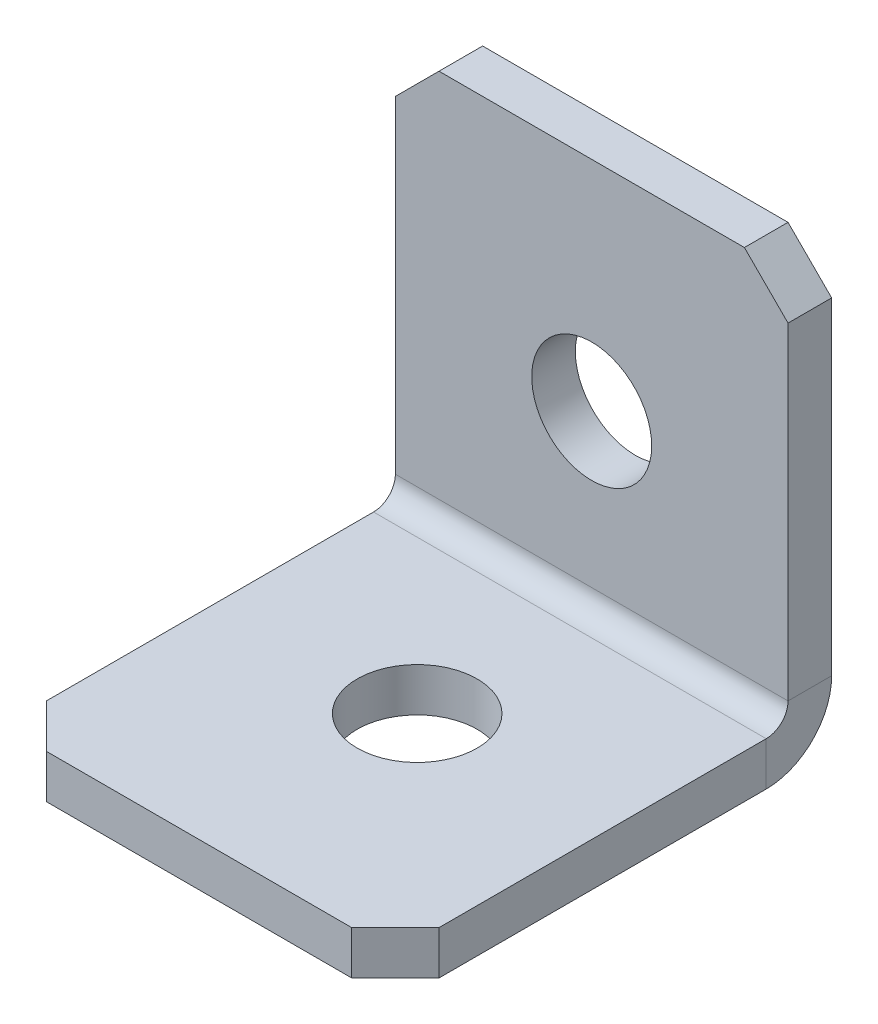
ISO-10303-21;
HEADER;
FILE_DESCRIPTION(('STEP AP214'),'2;1');
FILE_NAME('part.step','',(''),(''),'','','');
FILE_SCHEMA(('AUTOMOTIVE_DESIGN { 1 0 10303 214 1 1 1 1 }'));
ENDSEC;
DATA;
#1=APPLICATION_CONTEXT('core data for automotive mechanical design processes');
#2=APPLICATION_PROTOCOL_DEFINITION('international standard','automotive_design',2000,#1);
#3=PRODUCT_CONTEXT('',#1,'mechanical');
#4=PRODUCT('Part','Part','',(#3));
#5=PRODUCT_RELATED_PRODUCT_CATEGORY('part','',(#4));
#6=PRODUCT_DEFINITION_FORMATION('','',#4);
#7=PRODUCT_DEFINITION_CONTEXT('part definition',#1,'design');
#8=PRODUCT_DEFINITION('design','',#6,#7);
#9=PRODUCT_DEFINITION_SHAPE('','',#8);
#10=(LENGTH_UNIT() NAMED_UNIT(*) SI_UNIT(.MILLI.,.METRE.));
#11=(NAMED_UNIT(*) PLANE_ANGLE_UNIT() SI_UNIT($,.RADIAN.));
#12=(NAMED_UNIT(*) SI_UNIT($,.STERADIAN.) SOLID_ANGLE_UNIT());
#13=UNCERTAINTY_MEASURE_WITH_UNIT(LENGTH_MEASURE(1.E-05),#10,'distance_accuracy_value','');
#14=(GEOMETRIC_REPRESENTATION_CONTEXT(3) GLOBAL_UNCERTAINTY_ASSIGNED_CONTEXT((#13)) GLOBAL_UNIT_ASSIGNED_CONTEXT((#10,
#11,#12)) REPRESENTATION_CONTEXT('',''));
#15=CARTESIAN_POINT('',(0.,0.,0.));
#16=DIRECTION('',(0.,0.,1.));
#17=DIRECTION('',(1.,0.,0.));
#18=AXIS2_PLACEMENT_3D('',#15,#16,#17);
#19=CARTESIAN_POINT('',(0.,0.,2.));
#20=DIRECTION('',(0.,0.,-1.));
#21=DIRECTION('',(-1.,0.,0.));
#22=AXIS2_PLACEMENT_3D('',#19,#20,#21);
#23=PLANE('',#22);
#24=DIRECTION('',(-1.,0.,0.));
#25=VECTOR('',#24,1.);
#26=CARTESIAN_POINT('',(-9.,20.,2.));
#27=LINE('',#26,#25);
#28=CARTESIAN_POINT('',(6.99999999999999,20.,2.));
#29=VERTEX_POINT('',#28);
#30=CARTESIAN_POINT('',(-7.,20.,2.));
#31=VERTEX_POINT('',#30);
#32=EDGE_CURVE('E260',#29,#31,#27,.T.);
#33=ORIENTED_EDGE('',*,*,#32,.T.);
#34=DIRECTION('',(0.707106781186546,0.707106781186549,0.));
#35=VECTOR('',#34,1.);
#36=CARTESIAN_POINT('',(-7.,20.,2.));
#37=LINE('',#36,#35);
#38=CARTESIAN_POINT('',(-9.,18.,2.));
#39=VERTEX_POINT('',#38);
#40=EDGE_CURVE('E307',#31,#39,#37,.F.);
#41=ORIENTED_EDGE('',*,*,#40,.T.);
#42=DIRECTION('',(0.,-1.,0.));
#43=VECTOR('',#42,1.);
#44=CARTESIAN_POINT('',(-9.,0.,2.));
#45=LINE('',#44,#43);
#46=CARTESIAN_POINT('',(-9.,3.,2.));
#47=VERTEX_POINT('',#46);
#48=EDGE_CURVE('E252',#39,#47,#45,.T.);
#49=ORIENTED_EDGE('',*,*,#48,.T.);
#50=DIRECTION('',(1.,0.,0.));
#51=VECTOR('',#50,1.);
#52=CARTESIAN_POINT('',(9.,3.,2.));
#53=LINE('',#52,#51);
#54=CARTESIAN_POINT('',(9.,3.,2.));
#55=VERTEX_POINT('',#54);
#56=EDGE_CURVE('E239',#55,#47,#53,.F.);
#57=ORIENTED_EDGE('',*,*,#56,.F.);
#58=DIRECTION('',(0.,1.,0.));
#59=VECTOR('',#58,1.);
#60=CARTESIAN_POINT('',(9.,0.,2.));
#61=LINE('',#60,#59);
#62=CARTESIAN_POINT('',(9.,18.,2.));
#63=VERTEX_POINT('',#62);
#64=EDGE_CURVE('E255',#55,#63,#61,.T.);
#65=ORIENTED_EDGE('',*,*,#64,.T.);
#66=DIRECTION('',(0.707106781186549,-0.707106781186546,0.));
#67=VECTOR('',#66,1.);
#68=CARTESIAN_POINT('',(9.,18.,2.));
#69=LINE('',#68,#67);
#70=EDGE_CURVE('E304',#63,#29,#69,.F.);
#71=ORIENTED_EDGE('',*,*,#70,.T.);
#72=EDGE_LOOP('',(#33,#41,#49,#57,#65,#71));
#73=FACE_BOUND('',#72,.T.);
#74=CARTESIAN_POINT('',(0.,10.,2.));
#75=DIRECTION('',(0.,0.,1.));
#76=DIRECTION('',(1.,0.,0.));
#77=AXIS2_PLACEMENT_3D('',#74,#75,#76);
#78=CIRCLE('',#77,2.75);
#79=CARTESIAN_POINT('',(2.75,10.,2.));
#80=VERTEX_POINT('',#79);
#81=EDGE_CURVE('E634',#80,#80,#78,.T.);
#82=ORIENTED_EDGE('',*,*,#81,.F.);
#83=EDGE_LOOP('',(#82));
#84=FACE_BOUND('',#83,.T.);
#85=ADVANCED_FACE('F68',(#73,#84),#23,.F.);
#86=CARTESIAN_POINT('',(9.,0.,2.));
#87=DIRECTION('',(-1.,0.,0.));
#88=DIRECTION('',(0.,1.,0.));
#89=AXIS2_PLACEMENT_3D('',#86,#87,#88);
#90=PLANE('',#89);
#91=DIRECTION('',(0.,1.,0.));
#92=VECTOR('',#91,1.);
#93=CARTESIAN_POINT('',(9.,0.,0.));
#94=LINE('',#93,#92);
#95=CARTESIAN_POINT('',(9.,3.,0.));
#96=VERTEX_POINT('',#95);
#97=CARTESIAN_POINT('',(9.,18.,0.));
#98=VERTEX_POINT('',#97);
#99=EDGE_CURVE('E267',#96,#98,#94,.T.);
#100=ORIENTED_EDGE('',*,*,#99,.T.);
#101=DIRECTION('',(0.,0.,-1.));
#102=VECTOR('',#101,1.);
#103=CARTESIAN_POINT('',(9.,18.,2.));
#104=LINE('',#103,#102);
#105=EDGE_CURVE('E13',#98,#63,#104,.F.);
#106=ORIENTED_EDGE('',*,*,#105,.T.);
#107=ORIENTED_EDGE('',*,*,#64,.F.);
#108=DIRECTION('',(0.,0.,-1.));
#109=VECTOR('',#108,1.);
#110=CARTESIAN_POINT('',(9.,3.,2.));
#111=LINE('',#110,#109);
#112=EDGE_CURVE('E234',#55,#96,#111,.T.);
#113=ORIENTED_EDGE('',*,*,#112,.T.);
#114=EDGE_LOOP('',(#100,#106,#107,#113));
#115=FACE_BOUND('',#114,.T.);
#116=ADVANCED_FACE('F336',(#115),#90,.F.);
#117=CARTESIAN_POINT('',(0.,0.,0.));
#118=DIRECTION('',(0.,0.,-1.));
#119=DIRECTION('',(-1.,0.,0.));
#120=AXIS2_PLACEMENT_3D('',#117,#118,#119);
#121=PLANE('',#120);
#122=CARTESIAN_POINT('',(0.,10.,0.));
#123=DIRECTION('',(0.,0.,-1.));
#124=DIRECTION('',(-1.,0.,0.));
#125=AXIS2_PLACEMENT_3D('',#122,#123,#124);
#126=CIRCLE('',#125,2.75);
#127=CARTESIAN_POINT('',(-2.75,10.,0.));
#128=VERTEX_POINT('',#127);
#129=EDGE_CURVE('E229',#128,#128,#126,.T.);
#130=ORIENTED_EDGE('',*,*,#129,.F.);
#131=EDGE_LOOP('',(#130));
#132=FACE_BOUND('',#131,.T.);
#133=DIRECTION('',(0.,1.,0.));
#134=VECTOR('',#133,1.);
#135=CARTESIAN_POINT('',(-9.,0.,0.));
#136=LINE('',#135,#134);
#137=CARTESIAN_POINT('',(-9.,18.,0.));
#138=VERTEX_POINT('',#137);
#139=CARTESIAN_POINT('',(-9.,3.00000000000001,0.));
#140=VERTEX_POINT('',#139);
#141=EDGE_CURVE('E249',#138,#140,#136,.F.);
#142=ORIENTED_EDGE('',*,*,#141,.F.);
#143=DIRECTION('',(-0.707106781186546,-0.707106781186549,0.));
#144=VECTOR('',#143,1.);
#145=CARTESIAN_POINT('',(-13.5,13.5,0.));
#146=LINE('',#145,#144);
#147=CARTESIAN_POINT('',(-7.,20.,0.));
#148=VERTEX_POINT('',#147);
#149=EDGE_CURVE('E78',#138,#148,#146,.F.);
#150=ORIENTED_EDGE('',*,*,#149,.T.);
#151=DIRECTION('',(-1.,0.,0.));
#152=VECTOR('',#151,1.);
#153=CARTESIAN_POINT('',(0.,20.,0.));
#154=LINE('',#153,#152);
#155=CARTESIAN_POINT('',(6.99999999999999,20.,0.));
#156=VERTEX_POINT('',#155);
#157=EDGE_CURVE('E256',#156,#148,#154,.T.);
#158=ORIENTED_EDGE('',*,*,#157,.F.);
#159=DIRECTION('',(-0.707106781186549,0.707106781186546,0.));
#160=VECTOR('',#159,1.);
#161=CARTESIAN_POINT('',(13.5,13.5,0.));
#162=LINE('',#161,#160);
#163=EDGE_CURVE('E85',#156,#98,#162,.F.);
#164=ORIENTED_EDGE('',*,*,#163,.T.);
#165=ORIENTED_EDGE('',*,*,#99,.F.);
#166=DIRECTION('',(1.,0.,0.));
#167=VECTOR('',#166,1.);
#168=CARTESIAN_POINT('',(9.,3.,0.));
#169=LINE('',#168,#167);
#170=EDGE_CURVE('E170',#96,#140,#169,.F.);
#171=ORIENTED_EDGE('',*,*,#170,.T.);
#172=EDGE_LOOP('',(#142,#150,#158,#164,#165,#171));
#173=FACE_BOUND('',#172,.T.);
#174=ADVANCED_FACE('F317',(#132,#173),#121,.T.);
#175=CARTESIAN_POINT('',(-9.,20.,2.));
#176=DIRECTION('',(0.,-1.,0.));
#177=DIRECTION('',(-1.,0.,0.));
#178=AXIS2_PLACEMENT_3D('',#175,#176,#177);
#179=PLANE('',#178);
#180=ORIENTED_EDGE('',*,*,#157,.T.);
#181=DIRECTION('',(0.,0.,-1.));
#182=VECTOR('',#181,1.);
#183=CARTESIAN_POINT('',(-7.,20.,2.));
#184=LINE('',#183,#182);
#185=EDGE_CURVE('E300',#148,#31,#184,.F.);
#186=ORIENTED_EDGE('',*,*,#185,.T.);
#187=ORIENTED_EDGE('',*,*,#32,.F.);
#188=DIRECTION('',(0.,0.,1.));
#189=VECTOR('',#188,1.);
#190=CARTESIAN_POINT('',(6.99999999999999,20.,2.));
#191=LINE('',#190,#189);
#192=EDGE_CURVE('E297',#29,#156,#191,.F.);
#193=ORIENTED_EDGE('',*,*,#192,.T.);
#194=EDGE_LOOP('',(#180,#186,#187,#193));
#195=FACE_BOUND('',#194,.T.);
#196=ADVANCED_FACE('F321',(#195),#179,.F.);
#197=CARTESIAN_POINT('',(-9.,0.,2.));
#198=DIRECTION('',(1.,0.,0.));
#199=DIRECTION('',(0.,-1.,0.));
#200=AXIS2_PLACEMENT_3D('',#197,#198,#199);
#201=PLANE('',#200);
#202=ORIENTED_EDGE('',*,*,#48,.F.);
#203=DIRECTION('',(0.,0.,1.));
#204=VECTOR('',#203,1.);
#205=CARTESIAN_POINT('',(-9.,18.,2.));
#206=LINE('',#205,#204);
#207=EDGE_CURVE('E93',#39,#138,#206,.F.);
#208=ORIENTED_EDGE('',*,*,#207,.T.);
#209=ORIENTED_EDGE('',*,*,#141,.T.);
#210=DIRECTION('',(0.,0.,-1.));
#211=VECTOR('',#210,1.);
#212=CARTESIAN_POINT('',(-9.,3.,2.));
#213=LINE('',#212,#211);
#214=EDGE_CURVE('E245',#47,#140,#213,.T.);
#215=ORIENTED_EDGE('',*,*,#214,.F.);
#216=EDGE_LOOP('',(#202,#208,#209,#215));
#217=FACE_BOUND('',#216,.T.);
#218=ADVANCED_FACE('F329',(#217),#201,.F.);
#219=CARTESIAN_POINT('',(-9.,3.,3.));
#220=DIRECTION('',(-1.,0.,0.));
#221=DIRECTION('',(0.,0.,1.));
#222=AXIS2_PLACEMENT_3D('',#219,#220,#221);
#223=PLANE('',#222);
#224=DIRECTION('',(0.,1.,0.));
#225=VECTOR('',#224,1.);
#226=CARTESIAN_POINT('',(-9.,0.,2.99999999999999));
#227=LINE('',#226,#225);
#228=CARTESIAN_POINT('',(-9.,2.,3.));
#229=VERTEX_POINT('',#228);
#230=CARTESIAN_POINT('',(-9.,0.,2.99999999999999));
#231=VERTEX_POINT('',#230);
#232=EDGE_CURVE('E225',#229,#231,#227,.F.);
#233=ORIENTED_EDGE('',*,*,#232,.F.);
#234=CARTESIAN_POINT('',(-9.,3.,3.));
#235=DIRECTION('',(1.,0.,0.));
#236=DIRECTION('',(0.,0.,-1.));
#237=AXIS2_PLACEMENT_3D('',#234,#235,#236);
#238=CIRCLE('',#237,1.);
#239=EDGE_CURVE('E174',#47,#229,#238,.F.);
#240=ORIENTED_EDGE('',*,*,#239,.F.);
#241=ORIENTED_EDGE('',*,*,#214,.T.);
#242=CARTESIAN_POINT('',(-9.,3.,3.));
#243=DIRECTION('',(1.,0.,0.));
#244=DIRECTION('',(0.,0.,-1.));
#245=AXIS2_PLACEMENT_3D('',#242,#243,#244);
#246=CIRCLE('',#245,3.);
#247=EDGE_CURVE('E232',#140,#231,#246,.F.);
#248=ORIENTED_EDGE('',*,*,#247,.T.);
#249=EDGE_LOOP('',(#233,#240,#241,#248));
#250=FACE_BOUND('',#249,.T.);
#251=ADVANCED_FACE('F333',(#250),#223,.T.);
#252=CARTESIAN_POINT('',(9.,3.,3.));
#253=DIRECTION('',(-1.,0.,0.));
#254=DIRECTION('',(0.,0.,1.));
#255=AXIS2_PLACEMENT_3D('',#252,#253,#254);
#256=PLANE('',#255);
#257=CARTESIAN_POINT('',(9.,3.,3.));
#258=DIRECTION('',(1.,0.,0.));
#259=DIRECTION('',(0.,0.,-1.));
#260=AXIS2_PLACEMENT_3D('',#257,#258,#259);
#261=CIRCLE('',#260,1.);
#262=CARTESIAN_POINT('',(9.,2.,3.));
#263=VERTEX_POINT('',#262);
#264=EDGE_CURVE('E181',#263,#55,#261,.T.);
#265=ORIENTED_EDGE('',*,*,#264,.F.);
#266=DIRECTION('',(0.,1.,0.));
#267=VECTOR('',#266,1.);
#268=CARTESIAN_POINT('',(9.,2.,3.));
#269=LINE('',#268,#267);
#270=CARTESIAN_POINT('',(9.,0.,2.99999999999999));
#271=VERTEX_POINT('',#270);
#272=EDGE_CURVE('E178',#263,#271,#269,.F.);
#273=ORIENTED_EDGE('',*,*,#272,.T.);
#274=CARTESIAN_POINT('',(9.,3.,3.));
#275=DIRECTION('',(1.,0.,0.));
#276=DIRECTION('',(0.,0.,-1.));
#277=AXIS2_PLACEMENT_3D('',#274,#275,#276);
#278=CIRCLE('',#277,3.);
#279=EDGE_CURVE('E162',#271,#96,#278,.T.);
#280=ORIENTED_EDGE('',*,*,#279,.T.);
#281=ORIENTED_EDGE('',*,*,#112,.F.);
#282=EDGE_LOOP('',(#265,#273,#280,#281));
#283=FACE_BOUND('',#282,.T.);
#284=ADVANCED_FACE('F179',(#283),#256,.F.);
#285=CARTESIAN_POINT('',(9.,3.,3.));
#286=DIRECTION('',(1.,0.,0.));
#287=DIRECTION('',(0.,-1.,0.));
#288=AXIS2_PLACEMENT_3D('',#285,#286,#287);
#289=CYLINDRICAL_SURFACE('',#288,3.);
#290=ORIENTED_EDGE('',*,*,#170,.F.);
#291=ORIENTED_EDGE('',*,*,#279,.F.);
#292=DIRECTION('',(1.,0.,0.));
#293=VECTOR('',#292,1.);
#294=CARTESIAN_POINT('',(-9.,0.,2.99999999999999));
#295=LINE('',#294,#293);
#296=EDGE_CURVE('E167',#271,#231,#295,.F.);
#297=ORIENTED_EDGE('',*,*,#296,.T.);
#298=ORIENTED_EDGE('',*,*,#247,.F.);
#299=EDGE_LOOP('',(#290,#291,#297,#298));
#300=FACE_BOUND('',#299,.T.);
#301=ADVANCED_FACE('F164',(#300),#289,.T.);
#302=CARTESIAN_POINT('',(9.,3.,3.));
#303=DIRECTION('',(1.,0.,0.));
#304=DIRECTION('',(0.,-1.,0.));
#305=AXIS2_PLACEMENT_3D('',#302,#303,#304);
#306=CYLINDRICAL_SURFACE('',#305,1.);
#307=ORIENTED_EDGE('',*,*,#56,.T.);
#308=ORIENTED_EDGE('',*,*,#239,.T.);
#309=DIRECTION('',(1.,0.,0.));
#310=VECTOR('',#309,1.);
#311=CARTESIAN_POINT('',(-9.,2.,3.));
#312=LINE('',#311,#310);
#313=EDGE_CURVE('E187',#229,#263,#312,.T.);
#314=ORIENTED_EDGE('',*,*,#313,.T.);
#315=ORIENTED_EDGE('',*,*,#264,.T.);
#316=EDGE_LOOP('',(#307,#308,#314,#315));
#317=FACE_BOUND('',#316,.T.);
#318=ADVANCED_FACE('F340',(#317),#306,.F.);
#319=CARTESIAN_POINT('',(-9.,0.,1.99999999999999));
#320=DIRECTION('',(1.,0.,0.));
#321=DIRECTION('',(0.,0.,-1.));
#322=AXIS2_PLACEMENT_3D('',#319,#320,#321);
#323=PLANE('',#322);
#324=DIRECTION('',(0.,0.,-1.));
#325=VECTOR('',#324,1.);
#326=CARTESIAN_POINT('',(-9.,0.,0.));
#327=LINE('',#326,#325);
#328=CARTESIAN_POINT('',(-9.,0.,18.));
#329=VERTEX_POINT('',#328);
#330=EDGE_CURVE('E195',#329,#231,#327,.T.);
#331=ORIENTED_EDGE('',*,*,#330,.F.);
#332=DIRECTION('',(0.,1.,0.));
#333=VECTOR('',#332,1.);
#334=CARTESIAN_POINT('',(-9.,0.,18.));
#335=LINE('',#334,#333);
#336=CARTESIAN_POINT('',(-9.,1.99999999999994,18.));
#337=VERTEX_POINT('',#336);
#338=EDGE_CURVE('E293',#329,#337,#335,.T.);
#339=ORIENTED_EDGE('',*,*,#338,.T.);
#340=DIRECTION('',(0.,0.,1.));
#341=VECTOR('',#340,1.);
#342=CARTESIAN_POINT('',(-9.,2.,2.));
#343=LINE('',#342,#341);
#344=EDGE_CURVE('E197',#337,#229,#343,.F.);
#345=ORIENTED_EDGE('',*,*,#344,.T.);
#346=ORIENTED_EDGE('',*,*,#232,.T.);
#347=EDGE_LOOP('',(#331,#339,#345,#346));
#348=FACE_BOUND('',#347,.T.);
#349=ADVANCED_FACE('F358',(#348),#323,.F.);
#350=CARTESIAN_POINT('',(9.,0.,20.));
#351=DIRECTION('',(-1.,0.,0.));
#352=DIRECTION('',(0.,0.,1.));
#353=AXIS2_PLACEMENT_3D('',#350,#351,#352);
#354=PLANE('',#353);
#355=DIRECTION('',(0.,0.,-1.));
#356=VECTOR('',#355,1.);
#357=CARTESIAN_POINT('',(9.,1.99999999999994,20.));
#358=LINE('',#357,#356);
#359=CARTESIAN_POINT('',(9.,1.99999999999994,18.));
#360=VERTEX_POINT('',#359);
#361=EDGE_CURVE('E218',#263,#360,#358,.F.);
#362=ORIENTED_EDGE('',*,*,#361,.T.);
#363=DIRECTION('',(0.,-1.,0.));
#364=VECTOR('',#363,1.);
#365=CARTESIAN_POINT('',(9.,0.,18.));
#366=LINE('',#365,#364);
#367=CARTESIAN_POINT('',(9.,0.,18.));
#368=VERTEX_POINT('',#367);
#369=EDGE_CURVE('E201',#360,#368,#366,.T.);
#370=ORIENTED_EDGE('',*,*,#369,.T.);
#371=DIRECTION('',(0.,0.,1.));
#372=VECTOR('',#371,1.);
#373=CARTESIAN_POINT('',(9.,0.,0.));
#374=LINE('',#373,#372);
#375=EDGE_CURVE('E192',#271,#368,#374,.T.);
#376=ORIENTED_EDGE('',*,*,#375,.F.);
#377=ORIENTED_EDGE('',*,*,#272,.F.);
#378=EDGE_LOOP('',(#362,#370,#376,#377));
#379=FACE_BOUND('',#378,.T.);
#380=ADVANCED_FACE('F199',(#379),#354,.F.);
#381=CARTESIAN_POINT('',(0.,0.,0.));
#382=DIRECTION('',(0.,1.,0.));
#383=DIRECTION('',(0.,0.,1.));
#384=AXIS2_PLACEMENT_3D('',#381,#382,#383);
#385=PLANE('',#384);
#386=CARTESIAN_POINT('',(0.,0.,10.));
#387=DIRECTION('',(0.,1.,0.));
#388=DIRECTION('',(0.,0.,1.));
#389=AXIS2_PLACEMENT_3D('',#386,#387,#388);
#390=CIRCLE('',#389,2.74999999999999);
#391=CARTESIAN_POINT('',(0.,0.,12.75));
#392=VERTEX_POINT('',#391);
#393=EDGE_CURVE('E632',#392,#392,#390,.T.);
#394=ORIENTED_EDGE('',*,*,#393,.T.);
#395=EDGE_LOOP('',(#394));
#396=FACE_BOUND('',#395,.T.);
#397=ORIENTED_EDGE('',*,*,#375,.T.);
#398=DIRECTION('',(0.707106781186546,0.,-0.707106781186549));
#399=VECTOR('',#398,1.);
#400=CARTESIAN_POINT('',(7.,0.,20.));
#401=LINE('',#400,#399);
#402=CARTESIAN_POINT('',(7.,0.,20.));
#403=VERTEX_POINT('',#402);
#404=EDGE_CURVE('E290',#368,#403,#401,.F.);
#405=ORIENTED_EDGE('',*,*,#404,.T.);
#406=DIRECTION('',(-1.,0.,0.));
#407=VECTOR('',#406,1.);
#408=CARTESIAN_POINT('',(0.,0.,20.));
#409=LINE('',#408,#407);
#410=CARTESIAN_POINT('',(-7.,0.,20.));
#411=VERTEX_POINT('',#410);
#412=EDGE_CURVE('E203',#403,#411,#409,.T.);
#413=ORIENTED_EDGE('',*,*,#412,.T.);
#414=DIRECTION('',(0.707106781186549,0.,0.707106781186546));
#415=VECTOR('',#414,1.);
#416=CARTESIAN_POINT('',(-9.,0.,18.));
#417=LINE('',#416,#415);
#418=EDGE_CURVE('E287',#411,#329,#417,.F.);
#419=ORIENTED_EDGE('',*,*,#418,.T.);
#420=ORIENTED_EDGE('',*,*,#330,.T.);
#421=ORIENTED_EDGE('',*,*,#296,.F.);
#422=EDGE_LOOP('',(#397,#405,#413,#419,#420,#421));
#423=FACE_BOUND('',#422,.T.);
#424=ADVANCED_FACE('F191',(#396,#423),#385,.F.);
#425=CARTESIAN_POINT('',(0.,2.00000000000001,0.));
#426=DIRECTION('',(0.,1.,0.));
#427=DIRECTION('',(0.,0.,1.));
#428=AXIS2_PLACEMENT_3D('',#425,#426,#427);
#429=PLANE('',#428);
#430=CARTESIAN_POINT('',(0.,1.99999999999997,10.));
#431=DIRECTION('',(0.,1.,0.));
#432=DIRECTION('',(0.,0.,1.));
#433=AXIS2_PLACEMENT_3D('',#430,#431,#432);
#434=CIRCLE('',#433,2.74999999999999);
#435=CARTESIAN_POINT('',(0.,1.99999999999996,12.75));
#436=VERTEX_POINT('',#435);
#437=EDGE_CURVE('E635',#436,#436,#434,.T.);
#438=ORIENTED_EDGE('',*,*,#437,.F.);
#439=EDGE_LOOP('',(#438));
#440=FACE_BOUND('',#439,.T.);
#441=DIRECTION('',(1.,0.,0.));
#442=VECTOR('',#441,1.);
#443=CARTESIAN_POINT('',(-9.,1.99999999999994,20.));
#444=LINE('',#443,#442);
#445=CARTESIAN_POINT('',(7.,1.99999999999994,20.));
#446=VERTEX_POINT('',#445);
#447=CARTESIAN_POINT('',(-7.,1.99999999999994,20.));
#448=VERTEX_POINT('',#447);
#449=EDGE_CURVE('E211',#446,#448,#444,.F.);
#450=ORIENTED_EDGE('',*,*,#449,.F.);
#451=DIRECTION('',(-0.707106781186546,0.,0.707106781186549));
#452=VECTOR('',#451,1.);
#453=CARTESIAN_POINT('',(13.5,1.99999999999996,13.5));
#454=LINE('',#453,#452);
#455=EDGE_CURVE('E282',#446,#360,#454,.F.);
#456=ORIENTED_EDGE('',*,*,#455,.T.);
#457=ORIENTED_EDGE('',*,*,#361,.F.);
#458=ORIENTED_EDGE('',*,*,#313,.F.);
#459=ORIENTED_EDGE('',*,*,#344,.F.);
#460=DIRECTION('',(-0.707106781186549,0.,-0.707106781186546));
#461=VECTOR('',#460,1.);
#462=CARTESIAN_POINT('',(-13.5,1.99999999999996,13.5));
#463=LINE('',#462,#461);
#464=EDGE_CURVE('E279',#337,#448,#463,.F.);
#465=ORIENTED_EDGE('',*,*,#464,.T.);
#466=EDGE_LOOP('',(#450,#456,#457,#458,#459,#465));
#467=FACE_BOUND('',#466,.T.);
#468=ADVANCED_FACE('F345',(#440,#467),#429,.T.);
#469=CARTESIAN_POINT('',(-9.,0.,20.));
#470=DIRECTION('',(0.,0.,-1.));
#471=DIRECTION('',(0.,1.,0.));
#472=AXIS2_PLACEMENT_3D('',#469,#470,#471);
#473=PLANE('',#472);
#474=ORIENTED_EDGE('',*,*,#412,.F.);
#475=DIRECTION('',(0.,1.,0.));
#476=VECTOR('',#475,1.);
#477=CARTESIAN_POINT('',(7.,0.,20.));
#478=LINE('',#477,#476);
#479=EDGE_CURVE('E275',#403,#446,#478,.T.);
#480=ORIENTED_EDGE('',*,*,#479,.T.);
#481=ORIENTED_EDGE('',*,*,#449,.T.);
#482=DIRECTION('',(0.,-1.,0.));
#483=VECTOR('',#482,1.);
#484=CARTESIAN_POINT('',(-7.,0.,20.));
#485=LINE('',#484,#483);
#486=EDGE_CURVE('E264',#448,#411,#485,.T.);
#487=ORIENTED_EDGE('',*,*,#486,.T.);
#488=EDGE_LOOP('',(#474,#480,#481,#487));
#489=FACE_BOUND('',#488,.T.);
#490=ADVANCED_FACE('F352',(#489),#473,.F.);
#491=CARTESIAN_POINT('',(0.,10.,2.));
#492=DIRECTION('',(0.,0.,1.));
#493=DIRECTION('',(1.,0.,0.));
#494=AXIS2_PLACEMENT_3D('',#491,#492,#493);
#495=CYLINDRICAL_SURFACE('',#494,2.75);
#496=ORIENTED_EDGE('',*,*,#81,.T.);
#497=EDGE_LOOP('',(#496));
#498=FACE_BOUND('',#497,.T.);
#499=ORIENTED_EDGE('',*,*,#129,.T.);
#500=EDGE_LOOP('',(#499));
#501=FACE_BOUND('',#500,.T.);
#502=ADVANCED_FACE('F424',(#498,#501),#495,.F.);
#503=CARTESIAN_POINT('',(0.,1.99999999999997,10.));
#504=DIRECTION('',(0.,1.,0.));
#505=DIRECTION('',(0.,0.,1.));
#506=AXIS2_PLACEMENT_3D('',#503,#504,#505);
#507=CYLINDRICAL_SURFACE('',#506,2.74999999999999);
#508=ORIENTED_EDGE('',*,*,#393,.F.);
#509=EDGE_LOOP('',(#508));
#510=FACE_BOUND('',#509,.T.);
#511=ORIENTED_EDGE('',*,*,#437,.T.);
#512=EDGE_LOOP('',(#511));
#513=FACE_BOUND('',#512,.T.);
#514=ADVANCED_FACE('F390',(#510,#513),#507,.F.);
#515=CARTESIAN_POINT('',(7.,0.,20.));
#516=DIRECTION('',(-0.707106781186549,0.,-0.707106781186546));
#517=DIRECTION('',(0.,1.,0.));
#518=AXIS2_PLACEMENT_3D('',#515,#516,#517);
#519=PLANE('',#518);
#520=ORIENTED_EDGE('',*,*,#404,.F.);
#521=ORIENTED_EDGE('',*,*,#369,.F.);
#522=ORIENTED_EDGE('',*,*,#455,.F.);
#523=ORIENTED_EDGE('',*,*,#479,.F.);
#524=EDGE_LOOP('',(#520,#521,#522,#523));
#525=FACE_BOUND('',#524,.T.);
#526=ADVANCED_FACE('F347',(#525),#519,.F.);
#527=CARTESIAN_POINT('',(-9.,0.,18.));
#528=DIRECTION('',(0.707106781186546,0.,-0.707106781186549));
#529=DIRECTION('',(0.,1.,0.));
#530=AXIS2_PLACEMENT_3D('',#527,#528,#529);
#531=PLANE('',#530);
#532=ORIENTED_EDGE('',*,*,#418,.F.);
#533=ORIENTED_EDGE('',*,*,#486,.F.);
#534=ORIENTED_EDGE('',*,*,#464,.F.);
#535=ORIENTED_EDGE('',*,*,#338,.F.);
#536=EDGE_LOOP('',(#532,#533,#534,#535));
#537=FACE_BOUND('',#536,.T.);
#538=ADVANCED_FACE('F355',(#537),#531,.F.);
#539=CARTESIAN_POINT('',(-7.,20.,2.));
#540=DIRECTION('',(0.707106781186549,-0.707106781186546,0.));
#541=DIRECTION('',(0.,0.,1.));
#542=AXIS2_PLACEMENT_3D('',#539,#540,#541);
#543=PLANE('',#542);
#544=ORIENTED_EDGE('',*,*,#149,.F.);
#545=ORIENTED_EDGE('',*,*,#207,.F.);
#546=ORIENTED_EDGE('',*,*,#40,.F.);
#547=ORIENTED_EDGE('',*,*,#185,.F.);
#548=EDGE_LOOP('',(#544,#545,#546,#547));
#549=FACE_BOUND('',#548,.T.);
#550=ADVANCED_FACE('F324',(#549),#543,.F.);
#551=CARTESIAN_POINT('',(9.,18.,2.));
#552=DIRECTION('',(-0.707106781186546,-0.707106781186549,0.));
#553=DIRECTION('',(0.,0.,1.));
#554=AXIS2_PLACEMENT_3D('',#551,#552,#553);
#555=PLANE('',#554);
#556=ORIENTED_EDGE('',*,*,#163,.F.);
#557=ORIENTED_EDGE('',*,*,#192,.F.);
#558=ORIENTED_EDGE('',*,*,#70,.F.);
#559=ORIENTED_EDGE('',*,*,#105,.F.);
#560=EDGE_LOOP('',(#556,#557,#558,#559));
#561=FACE_BOUND('',#560,.T.);
#562=ADVANCED_FACE('F71',(#561),#555,.F.);
#563=CLOSED_SHELL('',(#85,#116,#174,#196,#218,#251,#284,#301,#318,#349,#380,#424,#468,#490,#502,
#514,#526,#538,#550,#562));
#564=MANIFOLD_SOLID_BREP('B2',#563);
#565=ADVANCED_BREP_SHAPE_REPRESENTATION('',(#18,#564),#14);
#566=SHAPE_DEFINITION_REPRESENTATION(#9,#565);
ENDSEC;
END-ISO-10303-21;
